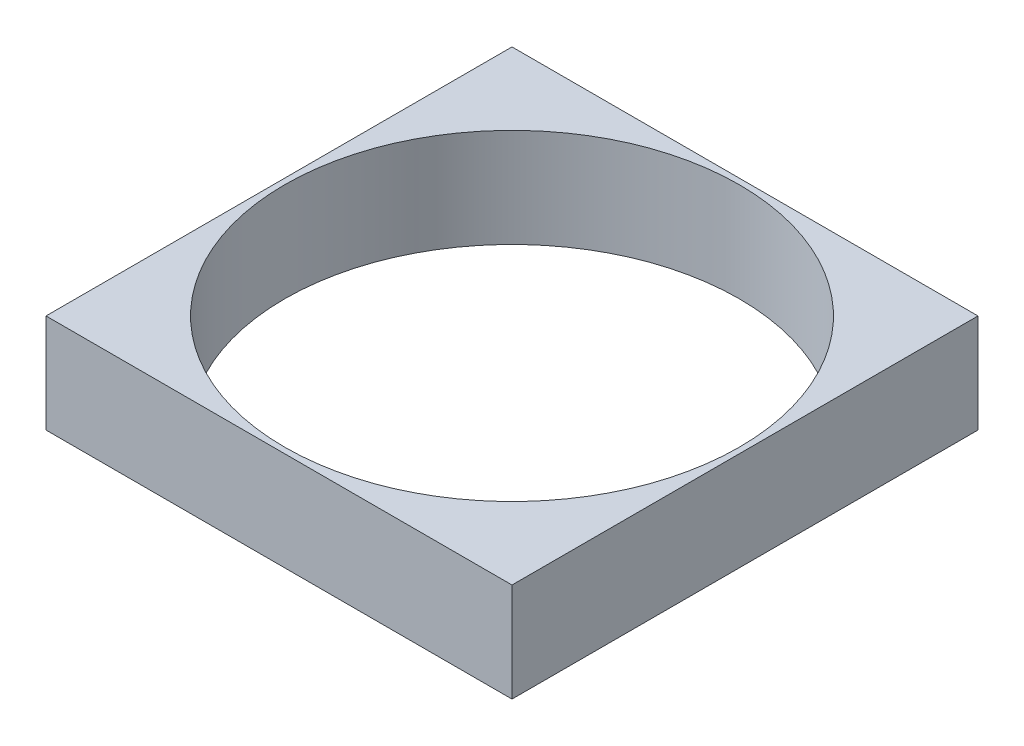
ISO-10303-21;
HEADER;
FILE_DESCRIPTION(('STEP AP214'),'2;1');
FILE_NAME('part.step','',(''),(''),'','','');
FILE_SCHEMA(('AUTOMOTIVE_DESIGN { 1 0 10303 214 1 1 1 1 }'));
ENDSEC;
DATA;
#1=APPLICATION_CONTEXT('core data for automotive mechanical design processes');
#2=APPLICATION_PROTOCOL_DEFINITION('international standard','automotive_design',2000,#1);
#3=PRODUCT_CONTEXT('',#1,'mechanical');
#4=PRODUCT('Part','Part','',(#3));
#5=PRODUCT_RELATED_PRODUCT_CATEGORY('part','',(#4));
#6=PRODUCT_DEFINITION_FORMATION('','',#4);
#7=PRODUCT_DEFINITION_CONTEXT('part definition',#1,'design');
#8=PRODUCT_DEFINITION('design','',#6,#7);
#9=PRODUCT_DEFINITION_SHAPE('','',#8);
#10=(LENGTH_UNIT() NAMED_UNIT(*) SI_UNIT(.MILLI.,.METRE.));
#11=(NAMED_UNIT(*) PLANE_ANGLE_UNIT() SI_UNIT($,.RADIAN.));
#12=(NAMED_UNIT(*) SI_UNIT($,.STERADIAN.) SOLID_ANGLE_UNIT());
#13=UNCERTAINTY_MEASURE_WITH_UNIT(LENGTH_MEASURE(1.E-05),#10,'distance_accuracy_value','');
#14=(GEOMETRIC_REPRESENTATION_CONTEXT(3) GLOBAL_UNCERTAINTY_ASSIGNED_CONTEXT((#13)) GLOBAL_UNIT_ASSIGNED_CONTEXT((#10,
#11,#12)) REPRESENTATION_CONTEXT('',''));
#15=CARTESIAN_POINT('',(0.,0.,0.));
#16=DIRECTION('',(0.,0.,1.));
#17=DIRECTION('',(1.,0.,0.));
#18=AXIS2_PLACEMENT_3D('',#15,#16,#17);
#19=CARTESIAN_POINT('',(0.,25.4000000000001,0.));
#20=DIRECTION('',(1.,0.,0.));
#21=DIRECTION('',(0.,0.,-1.));
#22=AXIS2_PLACEMENT_3D('',#19,#20,#21);
#23=PLANE('',#22);
#24=DIRECTION('',(0.,0.,1.));
#25=VECTOR('',#24,1.);
#26=CARTESIAN_POINT('',(0.,0.,0.));
#27=LINE('',#26,#25);
#28=CARTESIAN_POINT('',(0.,0.,-119.761));
#29=VERTEX_POINT('',#28);
#30=CARTESIAN_POINT('',(0.,0.,0.));
#31=VERTEX_POINT('',#30);
#32=EDGE_CURVE('E113',#29,#31,#27,.T.);
#33=ORIENTED_EDGE('',*,*,#32,.T.);
#34=DIRECTION('',(0.,-0.999999999999998,0.));
#35=VECTOR('',#34,1.);
#36=CARTESIAN_POINT('',(0.,25.4000000000001,0.));
#37=LINE('',#36,#35);
#38=CARTESIAN_POINT('',(0.,25.4000000000001,0.));
#39=VERTEX_POINT('',#38);
#40=EDGE_CURVE('E13',#39,#31,#37,.T.);
#41=ORIENTED_EDGE('',*,*,#40,.F.);
#42=DIRECTION('',(0.,0.,1.));
#43=VECTOR('',#42,1.);
#44=CARTESIAN_POINT('',(0.,25.4000000000001,0.));
#45=LINE('',#44,#43);
#46=CARTESIAN_POINT('',(0.,25.4000000000001,-119.761));
#47=VERTEX_POINT('',#46);
#48=EDGE_CURVE('E101',#47,#39,#45,.T.);
#49=ORIENTED_EDGE('',*,*,#48,.F.);
#50=DIRECTION('',(0.,-0.999999999999998,0.));
#51=VECTOR('',#50,1.);
#52=CARTESIAN_POINT('',(0.,25.4000000000001,-119.761));
#53=LINE('',#52,#51);
#54=EDGE_CURVE('E109',#47,#29,#53,.T.);
#55=ORIENTED_EDGE('',*,*,#54,.T.);
#56=EDGE_LOOP('',(#33,#41,#49,#55));
#57=FACE_BOUND('',#56,.T.);
#58=ADVANCED_FACE('F50',(#57),#23,.F.);
#59=CARTESIAN_POINT('',(0.,25.4000000000001,0.));
#60=DIRECTION('',(0.,0.,-1.));
#61=DIRECTION('',(-1.,0.,0.));
#62=AXIS2_PLACEMENT_3D('',#59,#60,#61);
#63=PLANE('',#62);
#64=DIRECTION('',(1.,0.,0.));
#65=VECTOR('',#64,1.);
#66=CARTESIAN_POINT('',(0.,0.,0.));
#67=LINE('',#66,#65);
#68=CARTESIAN_POINT('',(119.761,0.,0.));
#69=VERTEX_POINT('',#68);
#70=EDGE_CURVE('E105',#31,#69,#67,.T.);
#71=ORIENTED_EDGE('',*,*,#70,.T.);
#72=DIRECTION('',(0.,-0.999999999999998,0.));
#73=VECTOR('',#72,1.);
#74=CARTESIAN_POINT('',(119.761,25.4000000000001,0.));
#75=LINE('',#74,#73);
#76=CARTESIAN_POINT('',(119.761,25.4000000000001,0.));
#77=VERTEX_POINT('',#76);
#78=EDGE_CURVE('E58',#77,#69,#75,.T.);
#79=ORIENTED_EDGE('',*,*,#78,.F.);
#80=DIRECTION('',(1.,0.,0.));
#81=VECTOR('',#80,1.);
#82=CARTESIAN_POINT('',(0.,25.4000000000001,0.));
#83=LINE('',#82,#81);
#84=EDGE_CURVE('E96',#39,#77,#83,.T.);
#85=ORIENTED_EDGE('',*,*,#84,.F.);
#86=ORIENTED_EDGE('',*,*,#40,.T.);
#87=EDGE_LOOP('',(#71,#79,#85,#86));
#88=FACE_BOUND('',#87,.T.);
#89=ADVANCED_FACE('F104',(#88),#63,.F.);
#90=CARTESIAN_POINT('',(119.761,25.4000000000001,0.));
#91=DIRECTION('',(-1.,0.,0.));
#92=DIRECTION('',(0.,0.,1.));
#93=AXIS2_PLACEMENT_3D('',#90,#91,#92);
#94=PLANE('',#93);
#95=DIRECTION('',(0.,0.,-1.));
#96=VECTOR('',#95,1.);
#97=CARTESIAN_POINT('',(119.761,0.,0.));
#98=LINE('',#97,#96);
#99=CARTESIAN_POINT('',(119.761,0.,-119.761));
#100=VERTEX_POINT('',#99);
#101=EDGE_CURVE('E83',#69,#100,#98,.T.);
#102=ORIENTED_EDGE('',*,*,#101,.T.);
#103=DIRECTION('',(0.,-0.999999999999998,0.));
#104=VECTOR('',#103,1.);
#105=CARTESIAN_POINT('',(119.761,25.4000000000001,-119.761));
#106=LINE('',#105,#104);
#107=CARTESIAN_POINT('',(119.761,25.4000000000001,-119.761));
#108=VERTEX_POINT('',#107);
#109=EDGE_CURVE('E106',#108,#100,#106,.T.);
#110=ORIENTED_EDGE('',*,*,#109,.F.);
#111=DIRECTION('',(0.,0.,-1.));
#112=VECTOR('',#111,1.);
#113=CARTESIAN_POINT('',(119.761,25.4000000000001,0.));
#114=LINE('',#113,#112);
#115=EDGE_CURVE('E99',#77,#108,#114,.T.);
#116=ORIENTED_EDGE('',*,*,#115,.F.);
#117=ORIENTED_EDGE('',*,*,#78,.T.);
#118=EDGE_LOOP('',(#102,#110,#116,#117));
#119=FACE_BOUND('',#118,.T.);
#120=ADVANCED_FACE('F107',(#119),#94,.F.);
#121=CARTESIAN_POINT('',(0.,25.4000000000001,-119.761));
#122=DIRECTION('',(0.,0.,1.));
#123=DIRECTION('',(1.,0.,0.));
#124=AXIS2_PLACEMENT_3D('',#121,#122,#123);
#125=PLANE('',#124);
#126=DIRECTION('',(-1.,0.,0.));
#127=VECTOR('',#126,1.);
#128=CARTESIAN_POINT('',(0.,0.,-119.761));
#129=LINE('',#128,#127);
#130=EDGE_CURVE('E89',#100,#29,#129,.T.);
#131=ORIENTED_EDGE('',*,*,#130,.T.);
#132=ORIENTED_EDGE('',*,*,#54,.F.);
#133=DIRECTION('',(-1.,0.,0.));
#134=VECTOR('',#133,1.);
#135=CARTESIAN_POINT('',(0.,25.4000000000001,-119.761));
#136=LINE('',#135,#134);
#137=EDGE_CURVE('E66',#108,#47,#136,.T.);
#138=ORIENTED_EDGE('',*,*,#137,.F.);
#139=ORIENTED_EDGE('',*,*,#109,.T.);
#140=EDGE_LOOP('',(#131,#132,#138,#139));
#141=FACE_BOUND('',#140,.T.);
#142=ADVANCED_FACE('F121',(#141),#125,.F.);
#143=CARTESIAN_POINT('',(0.,25.4000000000001,0.));
#144=DIRECTION('',(0.,-0.999999999999998,0.));
#145=DIRECTION('',(0.,0.,-1.));
#146=AXIS2_PLACEMENT_3D('',#143,#144,#145);
#147=PLANE('',#146);
#148=CARTESIAN_POINT('',(59.8804999999997,25.4000000000001,-59.8805));
#149=DIRECTION('',(0.,0.999999999999998,0.));
#150=DIRECTION('',(0.,0.,1.));
#151=AXIS2_PLACEMENT_3D('',#148,#149,#150);
#152=CIRCLE('',#151,58.42);
#153=CARTESIAN_POINT('',(59.8804999999997,25.4000000000002,-1.4605));
#154=VERTEX_POINT('',#153);
#155=EDGE_CURVE('E127',#154,#154,#152,.T.);
#156=ORIENTED_EDGE('',*,*,#155,.F.);
#157=EDGE_LOOP('',(#156));
#158=FACE_BOUND('',#157,.T.);
#159=ORIENTED_EDGE('',*,*,#48,.T.);
#160=ORIENTED_EDGE('',*,*,#84,.T.);
#161=ORIENTED_EDGE('',*,*,#115,.T.);
#162=ORIENTED_EDGE('',*,*,#137,.T.);
#163=EDGE_LOOP('',(#159,#160,#161,#162));
#164=FACE_BOUND('',#163,.T.);
#165=ADVANCED_FACE('F97',(#158,#164),#147,.F.);
#166=CARTESIAN_POINT('',(0.,0.,0.));
#167=DIRECTION('',(0.,-0.999999999999998,0.));
#168=DIRECTION('',(0.,0.,-1.));
#169=AXIS2_PLACEMENT_3D('',#166,#167,#168);
#170=PLANE('',#169);
#171=CARTESIAN_POINT('',(59.8804999999997,0.,-59.8805));
#172=DIRECTION('',(0.,0.999999999999998,0.));
#173=DIRECTION('',(0.,0.,1.));
#174=AXIS2_PLACEMENT_3D('',#171,#172,#173);
#175=CIRCLE('',#174,58.42);
#176=CARTESIAN_POINT('',(59.8804999999997,0.,-1.4605));
#177=VERTEX_POINT('',#176);
#178=EDGE_CURVE('E116',#177,#177,#175,.T.);
#179=ORIENTED_EDGE('',*,*,#178,.T.);
#180=EDGE_LOOP('',(#179));
#181=FACE_BOUND('',#180,.T.);
#182=ORIENTED_EDGE('',*,*,#32,.F.);
#183=ORIENTED_EDGE('',*,*,#130,.F.);
#184=ORIENTED_EDGE('',*,*,#101,.F.);
#185=ORIENTED_EDGE('',*,*,#70,.F.);
#186=EDGE_LOOP('',(#182,#183,#184,#185));
#187=FACE_BOUND('',#186,.T.);
#188=ADVANCED_FACE('F124',(#181,#187),#170,.T.);
#189=CARTESIAN_POINT('',(59.8804999999997,0.,-59.8805));
#190=DIRECTION('',(0.,0.999999999999998,0.));
#191=DIRECTION('',(0.,0.,1.));
#192=AXIS2_PLACEMENT_3D('',#189,#190,#191);
#193=CYLINDRICAL_SURFACE('',#192,58.42);
#194=ORIENTED_EDGE('',*,*,#178,.F.);
#195=EDGE_LOOP('',(#194));
#196=FACE_BOUND('',#195,.T.);
#197=ORIENTED_EDGE('',*,*,#155,.T.);
#198=EDGE_LOOP('',(#197));
#199=FACE_BOUND('',#198,.T.);
#200=ADVANCED_FACE('F134',(#196,#199),#193,.F.);
#201=CLOSED_SHELL('',(#58,#89,#120,#142,#165,#188,#200));
#202=MANIFOLD_SOLID_BREP('B2',#201);
#203=ADVANCED_BREP_SHAPE_REPRESENTATION('',(#18,#202),#14);
#204=SHAPE_DEFINITION_REPRESENTATION(#9,#203);
ENDSEC;
END-ISO-10303-21;
